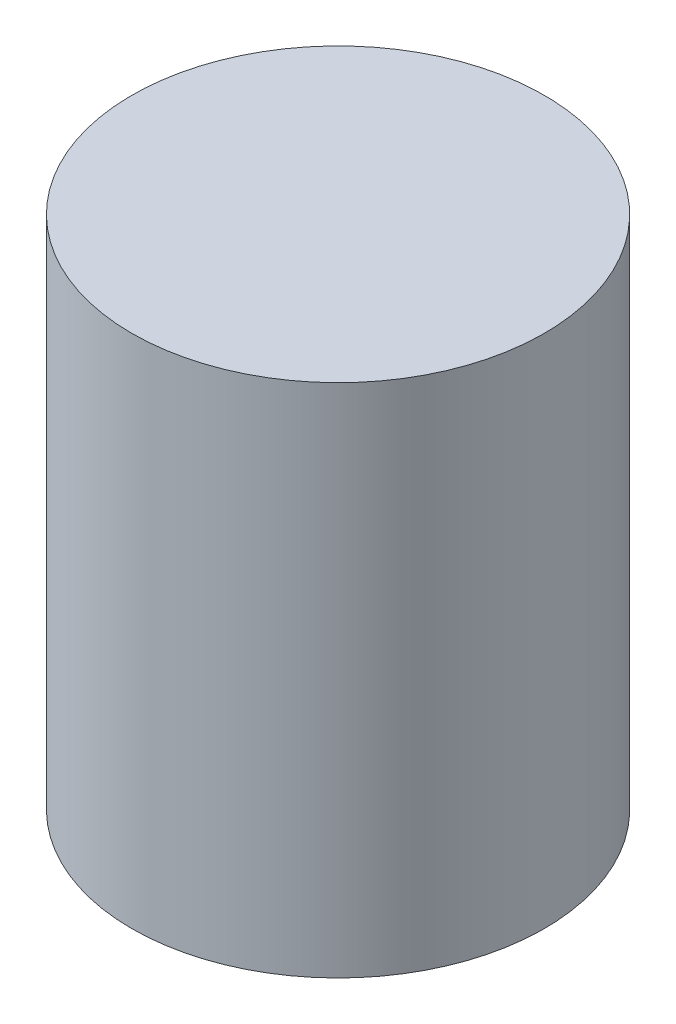
ISO-10303-21;
HEADER;
FILE_DESCRIPTION(('STEP AP214'),'2;1');
FILE_NAME('part.step','',(''),(''),'','','');
FILE_SCHEMA(('AUTOMOTIVE_DESIGN { 1 0 10303 214 1 1 1 1 }'));
ENDSEC;
DATA;
#1=APPLICATION_CONTEXT('core data for automotive mechanical design processes');
#2=APPLICATION_PROTOCOL_DEFINITION('international standard','automotive_design',2000,#1);
#3=PRODUCT_CONTEXT('',#1,'mechanical');
#4=PRODUCT('Part','Part','',(#3));
#5=PRODUCT_RELATED_PRODUCT_CATEGORY('part','',(#4));
#6=PRODUCT_DEFINITION_FORMATION('','',#4);
#7=PRODUCT_DEFINITION_CONTEXT('part definition',#1,'design');
#8=PRODUCT_DEFINITION('design','',#6,#7);
#9=PRODUCT_DEFINITION_SHAPE('','',#8);
#10=(LENGTH_UNIT() NAMED_UNIT(*) SI_UNIT(.MILLI.,.METRE.));
#11=(NAMED_UNIT(*) PLANE_ANGLE_UNIT() SI_UNIT($,.RADIAN.));
#12=(NAMED_UNIT(*) SI_UNIT($,.STERADIAN.) SOLID_ANGLE_UNIT());
#13=UNCERTAINTY_MEASURE_WITH_UNIT(LENGTH_MEASURE(1.E-05),#10,'distance_accuracy_value','');
#14=(GEOMETRIC_REPRESENTATION_CONTEXT(3) GLOBAL_UNCERTAINTY_ASSIGNED_CONTEXT((#13)) GLOBAL_UNIT_ASSIGNED_CONTEXT((#10,
#11,#12)) REPRESENTATION_CONTEXT('',''));
#15=CARTESIAN_POINT('',(0.,0.,0.));
#16=DIRECTION('',(0.,0.,1.));
#17=DIRECTION('',(1.,0.,0.));
#18=AXIS2_PLACEMENT_3D('',#15,#16,#17);
#19=CARTESIAN_POINT('',(0.,25.,0.));
#20=DIRECTION('',(0.,-1.,0.));
#21=DIRECTION('',(0.,0.,-1.));
#22=AXIS2_PLACEMENT_3D('',#19,#20,#21);
#23=CYLINDRICAL_SURFACE('',#22,10.);
#24=CARTESIAN_POINT('',(0.,25.,0.));
#25=DIRECTION('',(0.,1.,0.));
#26=DIRECTION('',(0.,0.,1.));
#27=AXIS2_PLACEMENT_3D('',#24,#25,#26);
#28=CIRCLE('',#27,10.);
#29=CARTESIAN_POINT('',(0.,25.,10.));
#30=VERTEX_POINT('',#29);
#31=EDGE_CURVE('E10',#30,#30,#28,.T.);
#32=ORIENTED_EDGE('',*,*,#31,.F.);
#33=EDGE_LOOP('',(#32));
#34=FACE_BOUND('',#33,.T.);
#35=CARTESIAN_POINT('',(0.,0.,0.));
#36=DIRECTION('',(0.,1.,0.));
#37=DIRECTION('',(0.,0.,1.));
#38=AXIS2_PLACEMENT_3D('',#35,#36,#37);
#39=CIRCLE('',#38,10.);
#40=CARTESIAN_POINT('',(0.,0.,10.));
#41=VERTEX_POINT('',#40);
#42=EDGE_CURVE('E34',#41,#41,#39,.T.);
#43=ORIENTED_EDGE('',*,*,#42,.T.);
#44=EDGE_LOOP('',(#43));
#45=FACE_BOUND('',#44,.T.);
#46=ADVANCED_FACE('F31',(#34,#45),#23,.T.);
#47=CARTESIAN_POINT('',(0.,25.,0.));
#48=DIRECTION('',(0.,1.,0.));
#49=DIRECTION('',(0.,0.,1.));
#50=AXIS2_PLACEMENT_3D('',#47,#48,#49);
#51=PLANE('',#50);
#52=ORIENTED_EDGE('',*,*,#31,.T.);
#53=EDGE_LOOP('',(#52));
#54=FACE_BOUND('',#53,.T.);
#55=ADVANCED_FACE('F46',(#54),#51,.T.);
#56=CARTESIAN_POINT('',(0.,0.,0.));
#57=DIRECTION('',(0.,1.,0.));
#58=DIRECTION('',(0.,0.,1.));
#59=AXIS2_PLACEMENT_3D('',#56,#57,#58);
#60=PLANE('',#59);
#61=ORIENTED_EDGE('',*,*,#42,.F.);
#62=EDGE_LOOP('',(#61));
#63=FACE_BOUND('',#62,.T.);
#64=ADVANCED_FACE('F44',(#63),#60,.F.);
#65=CLOSED_SHELL('',(#46,#55,#64));
#66=MANIFOLD_SOLID_BREP('B2',#65);
#67=ADVANCED_BREP_SHAPE_REPRESENTATION('',(#18,#66),#14);
#68=SHAPE_DEFINITION_REPRESENTATION(#9,#67);
ENDSEC;
END-ISO-10303-21;
